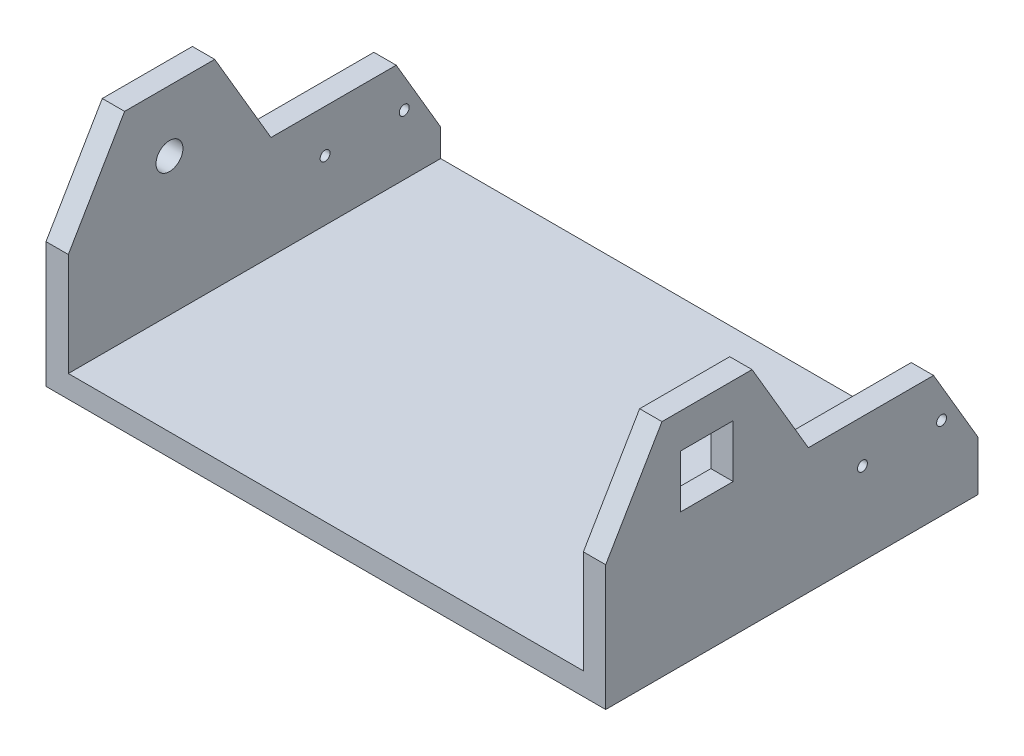
ISO-10303-21;
HEADER;
FILE_DESCRIPTION(('STEP AP214'),'2;1');
FILE_NAME('part.step','',(''),(''),'','','');
FILE_SCHEMA(('AUTOMOTIVE_DESIGN { 1 0 10303 214 1 1 1 1 }'));
ENDSEC;
DATA;
#1=APPLICATION_CONTEXT('core data for automotive mechanical design processes');
#2=APPLICATION_PROTOCOL_DEFINITION('international standard','automotive_design',2000,#1);
#3=PRODUCT_CONTEXT('',#1,'mechanical');
#4=PRODUCT('Part','Part','',(#3));
#5=PRODUCT_RELATED_PRODUCT_CATEGORY('part','',(#4));
#6=PRODUCT_DEFINITION_FORMATION('','',#4);
#7=PRODUCT_DEFINITION_CONTEXT('part definition',#1,'design');
#8=PRODUCT_DEFINITION('design','',#6,#7);
#9=PRODUCT_DEFINITION_SHAPE('','',#8);
#10=(LENGTH_UNIT() NAMED_UNIT(*) SI_UNIT(.MILLI.,.METRE.));
#11=(NAMED_UNIT(*) PLANE_ANGLE_UNIT() SI_UNIT($,.RADIAN.));
#12=(NAMED_UNIT(*) SI_UNIT($,.STERADIAN.) SOLID_ANGLE_UNIT());
#13=UNCERTAINTY_MEASURE_WITH_UNIT(LENGTH_MEASURE(1.E-05),#10,'distance_accuracy_value','');
#14=(GEOMETRIC_REPRESENTATION_CONTEXT(3) GLOBAL_UNCERTAINTY_ASSIGNED_CONTEXT((#13)) GLOBAL_UNIT_ASSIGNED_CONTEXT((#10,
#11,#12)) REPRESENTATION_CONTEXT('',''));
#15=CARTESIAN_POINT('',(0.,0.,0.));
#16=DIRECTION('',(0.,0.,1.));
#17=DIRECTION('',(1.,0.,0.));
#18=AXIS2_PLACEMENT_3D('',#15,#16,#17);
#19=CARTESIAN_POINT('',(0.,18.,0.));
#20=DIRECTION('',(0.,0.,-1.));
#21=DIRECTION('',(-1.,0.,0.));
#22=AXIS2_PLACEMENT_3D('',#19,#20,#21);
#23=PLANE('',#22);
#24=DIRECTION('',(1.,0.,0.));
#25=VECTOR('',#24,1.);
#26=CARTESIAN_POINT('',(0.,18.,0.));
#27=LINE('',#26,#25);
#28=CARTESIAN_POINT('',(18.,18.,0.));
#29=VERTEX_POINT('',#28);
#30=CARTESIAN_POINT('',(433.,18.,0.));
#31=VERTEX_POINT('',#30);
#32=EDGE_CURVE('E172',#29,#31,#27,.T.);
#33=ORIENTED_EDGE('',*,*,#32,.F.);
#34=DIRECTION('',(0.,1.,0.));
#35=VECTOR('',#34,1.);
#36=CARTESIAN_POINT('',(18.,101.059625537758,0.));
#37=LINE('',#36,#35);
#38=CARTESIAN_POINT('',(18.,101.059625537758,0.));
#39=VERTEX_POINT('',#38);
#40=EDGE_CURVE('E166',#29,#39,#37,.T.);
#41=ORIENTED_EDGE('',*,*,#40,.T.);
#42=DIRECTION('',(-1.,0.,0.));
#43=VECTOR('',#42,1.);
#44=CARTESIAN_POINT('',(18.,101.059625537758,0.));
#45=LINE('',#44,#43);
#46=CARTESIAN_POINT('',(0.,101.059625537758,0.));
#47=VERTEX_POINT('',#46);
#48=EDGE_CURVE('E169',#39,#47,#45,.T.);
#49=ORIENTED_EDGE('',*,*,#48,.T.);
#50=DIRECTION('',(0.,-1.,0.));
#51=VECTOR('',#50,1.);
#52=CARTESIAN_POINT('',(0.,18.,0.));
#53=LINE('',#52,#51);
#54=CARTESIAN_POINT('',(0.,0.,0.));
#55=VERTEX_POINT('',#54);
#56=EDGE_CURVE('E328',#47,#55,#53,.T.);
#57=ORIENTED_EDGE('',*,*,#56,.T.);
#58=DIRECTION('',(1.,0.,0.));
#59=VECTOR('',#58,1.);
#60=CARTESIAN_POINT('',(0.,0.,0.));
#61=LINE('',#60,#59);
#62=CARTESIAN_POINT('',(451.,0.,0.));
#63=VERTEX_POINT('',#62);
#64=EDGE_CURVE('E324',#55,#63,#61,.T.);
#65=ORIENTED_EDGE('',*,*,#64,.T.);
#66=DIRECTION('',(0.,-1.,0.));
#67=VECTOR('',#66,1.);
#68=CARTESIAN_POINT('',(451.,18.,0.));
#69=LINE('',#68,#67);
#70=CARTESIAN_POINT('',(451.,101.059625537758,0.));
#71=VERTEX_POINT('',#70);
#72=EDGE_CURVE('E11',#71,#63,#69,.T.);
#73=ORIENTED_EDGE('',*,*,#72,.F.);
#74=DIRECTION('',(1.,0.,0.));
#75=VECTOR('',#74,1.);
#76=CARTESIAN_POINT('',(433.,101.059625537758,0.));
#77=LINE('',#76,#75);
#78=CARTESIAN_POINT('',(433.,101.059625537758,0.));
#79=VERTEX_POINT('',#78);
#80=EDGE_CURVE('E309',#79,#71,#77,.T.);
#81=ORIENTED_EDGE('',*,*,#80,.F.);
#82=DIRECTION('',(0.,-1.,0.));
#83=VECTOR('',#82,1.);
#84=CARTESIAN_POINT('',(433.,0.,0.));
#85=LINE('',#84,#83);
#86=EDGE_CURVE('E293',#79,#31,#85,.T.);
#87=ORIENTED_EDGE('',*,*,#86,.T.);
#88=EDGE_LOOP('',(#33,#41,#49,#57,#65,#73,#81,#87));
#89=FACE_BOUND('',#88,.T.);
#90=ADVANCED_FACE('F32',(#89),#23,.F.);
#91=CARTESIAN_POINT('',(451.,18.,-300.));
#92=DIRECTION('',(-1.,0.,0.));
#93=DIRECTION('',(0.,0.,1.));
#94=AXIS2_PLACEMENT_3D('',#91,#92,#93);
#95=PLANE('',#94);
#96=DIRECTION('',(0.,0.,-1.));
#97=VECTOR('',#96,1.);
#98=CARTESIAN_POINT('',(451.,0.,-300.));
#99=LINE('',#98,#97);
#100=CARTESIAN_POINT('',(451.,0.,-300.));
#101=VERTEX_POINT('',#100);
#102=EDGE_CURVE('E330',#63,#101,#99,.T.);
#103=ORIENTED_EDGE('',*,*,#102,.T.);
#104=DIRECTION('',(0.,-1.,0.));
#105=VECTOR('',#104,1.);
#106=CARTESIAN_POINT('',(451.,18.,-300.));
#107=LINE('',#106,#105);
#108=CARTESIAN_POINT('',(451.,40.1073741437581,-300.));
#109=VERTEX_POINT('',#108);
#110=EDGE_CURVE('E39',#109,#101,#107,.T.);
#111=ORIENTED_EDGE('',*,*,#110,.F.);
#112=DIRECTION('',(0.,0.862288015351537,0.5064181854763));
#113=VECTOR('',#112,1.);
#114=CARTESIAN_POINT('',(451.,101.059625537758,-264.202994820634));
#115=LINE('',#114,#113);
#116=CARTESIAN_POINT('',(451.,101.059625537758,-264.202994820634));
#117=VERTEX_POINT('',#116);
#118=EDGE_CURVE('E268',#109,#117,#115,.T.);
#119=ORIENTED_EDGE('',*,*,#118,.T.);
#120=DIRECTION('',(0.,0.,1.));
#121=VECTOR('',#120,1.);
#122=CARTESIAN_POINT('',(451.,101.059625537758,-163.295274023895));
#123=LINE('',#122,#121);
#124=CARTESIAN_POINT('',(451.,101.059625537758,-163.295274023895));
#125=VERTEX_POINT('',#124);
#126=EDGE_CURVE('E298',#117,#125,#123,.T.);
#127=ORIENTED_EDGE('',*,*,#126,.T.);
#128=DIRECTION('',(0.,0.862288015351537,0.5064181854763));
#129=VECTOR('',#128,1.);
#130=CARTESIAN_POINT('',(451.,178.261418027833,-117.954980557792));
#131=LINE('',#130,#129);
#132=CARTESIAN_POINT('',(451.,178.261418027833,-117.954980557792));
#133=VERTEX_POINT('',#132);
#134=EDGE_CURVE('E301',#125,#133,#131,.T.);
#135=ORIENTED_EDGE('',*,*,#134,.T.);
#136=DIRECTION('',(0.,0.,1.));
#137=VECTOR('',#136,1.);
#138=CARTESIAN_POINT('',(451.,178.261418027833,-45.3423301195985));
#139=LINE('',#138,#137);
#140=CARTESIAN_POINT('',(451.,178.261418027833,-45.3423301195985));
#141=VERTEX_POINT('',#140);
#142=EDGE_CURVE('E304',#133,#141,#139,.T.);
#143=ORIENTED_EDGE('',*,*,#142,.T.);
#144=DIRECTION('',(0.,-0.862278081766698,0.506435099202991));
#145=VECTOR('',#144,1.);
#146=CARTESIAN_POINT('',(451.,101.059625537758,0.));
#147=LINE('',#146,#145);
#148=EDGE_CURVE('E278',#141,#71,#147,.T.);
#149=ORIENTED_EDGE('',*,*,#148,.T.);
#150=ORIENTED_EDGE('',*,*,#72,.T.);
#151=EDGE_LOOP('',(#103,#111,#119,#127,#135,#143,#149,#150));
#152=FACE_BOUND('',#151,.T.);
#153=CARTESIAN_POINT('',(451.,66.5,-270.64));
#154=DIRECTION('',(1.,0.,0.));
#155=DIRECTION('',(0.,0.,-1.));
#156=AXIS2_PLACEMENT_3D('',#153,#154,#155);
#157=CIRCLE('',#156,3.99999999999999);
#158=CARTESIAN_POINT('',(451.,66.5,-274.64));
#159=VERTEX_POINT('',#158);
#160=EDGE_CURVE('E230',#159,#159,#157,.T.);
#161=ORIENTED_EDGE('',*,*,#160,.F.);
#162=EDGE_LOOP('',(#161));
#163=FACE_BOUND('',#162,.T.);
#164=CARTESIAN_POINT('',(451.,66.5,-206.89));
#165=DIRECTION('',(1.,0.,0.));
#166=DIRECTION('',(0.,0.,-1.));
#167=AXIS2_PLACEMENT_3D('',#164,#165,#166);
#168=CIRCLE('',#167,3.99999999999999);
#169=CARTESIAN_POINT('',(451.,66.5,-210.89));
#170=VERTEX_POINT('',#169);
#171=EDGE_CURVE('E234',#170,#170,#168,.T.);
#172=ORIENTED_EDGE('',*,*,#171,.F.);
#173=EDGE_LOOP('',(#172));
#174=FACE_BOUND('',#173,.T.);
#175=DIRECTION('',(0.,0.,1.));
#176=VECTOR('',#175,1.);
#177=CARTESIAN_POINT('',(451.,150.25,-60.25));
#178=LINE('',#177,#176);
#179=CARTESIAN_POINT('',(451.,150.25,-102.75));
#180=VERTEX_POINT('',#179);
#181=CARTESIAN_POINT('',(451.,150.25,-60.25));
#182=VERTEX_POINT('',#181);
#183=EDGE_CURVE('E258',#180,#182,#178,.T.);
#184=ORIENTED_EDGE('',*,*,#183,.F.);
#185=DIRECTION('',(0.,1.,0.));
#186=VECTOR('',#185,1.);
#187=CARTESIAN_POINT('',(451.,150.25,-102.75));
#188=LINE('',#187,#186);
#189=CARTESIAN_POINT('',(451.,107.75,-102.75));
#190=VERTEX_POINT('',#189);
#191=EDGE_CURVE('E240',#190,#180,#188,.T.);
#192=ORIENTED_EDGE('',*,*,#191,.F.);
#193=DIRECTION('',(0.,0.,-1.));
#194=VECTOR('',#193,1.);
#195=CARTESIAN_POINT('',(451.,107.75,-60.25));
#196=LINE('',#195,#194);
#197=CARTESIAN_POINT('',(451.,107.75,-60.25));
#198=VERTEX_POINT('',#197);
#199=EDGE_CURVE('E247',#198,#190,#196,.T.);
#200=ORIENTED_EDGE('',*,*,#199,.F.);
#201=DIRECTION('',(0.,-1.,0.));
#202=VECTOR('',#201,1.);
#203=CARTESIAN_POINT('',(451.,150.25,-60.25));
#204=LINE('',#203,#202);
#205=EDGE_CURVE('E261',#182,#198,#204,.T.);
#206=ORIENTED_EDGE('',*,*,#205,.F.);
#207=EDGE_LOOP('',(#184,#192,#200,#206));
#208=FACE_BOUND('',#207,.T.);
#209=ADVANCED_FACE('F358',(#152,#163,#174,#208),#95,.F.);
#210=CARTESIAN_POINT('',(0.,18.,-300.));
#211=DIRECTION('',(0.,0.,1.));
#212=DIRECTION('',(1.,0.,0.));
#213=AXIS2_PLACEMENT_3D('',#210,#211,#212);
#214=PLANE('',#213);
#215=DIRECTION('',(-1.,0.,0.));
#216=VECTOR('',#215,1.);
#217=CARTESIAN_POINT('',(0.,0.,-300.));
#218=LINE('',#217,#216);
#219=CARTESIAN_POINT('',(0.,0.,-300.));
#220=VERTEX_POINT('',#219);
#221=EDGE_CURVE('E332',#101,#220,#218,.T.);
#222=ORIENTED_EDGE('',*,*,#221,.T.);
#223=DIRECTION('',(0.,-1.,0.));
#224=VECTOR('',#223,1.);
#225=CARTESIAN_POINT('',(0.,18.,-300.));
#226=LINE('',#225,#224);
#227=CARTESIAN_POINT('',(0.,40.1073741437581,-300.));
#228=VERTEX_POINT('',#227);
#229=EDGE_CURVE('E336',#228,#220,#226,.T.);
#230=ORIENTED_EDGE('',*,*,#229,.F.);
#231=DIRECTION('',(-1.,0.,0.));
#232=VECTOR('',#231,1.);
#233=CARTESIAN_POINT('',(18.,40.1073741437581,-300.));
#234=LINE('',#233,#232);
#235=CARTESIAN_POINT('',(18.,40.1073741437581,-300.));
#236=VERTEX_POINT('',#235);
#237=EDGE_CURVE('E219',#236,#228,#234,.T.);
#238=ORIENTED_EDGE('',*,*,#237,.F.);
#239=DIRECTION('',(0.,-1.,0.));
#240=VECTOR('',#239,1.);
#241=CARTESIAN_POINT('',(18.,0.,-300.));
#242=LINE('',#241,#240);
#243=CARTESIAN_POINT('',(18.,18.,-300.));
#244=VERTEX_POINT('',#243);
#245=EDGE_CURVE('E184',#236,#244,#242,.T.);
#246=ORIENTED_EDGE('',*,*,#245,.T.);
#247=DIRECTION('',(-1.,0.,0.));
#248=VECTOR('',#247,1.);
#249=CARTESIAN_POINT('',(0.,18.,-300.));
#250=LINE('',#249,#248);
#251=CARTESIAN_POINT('',(433.,18.,-300.));
#252=VERTEX_POINT('',#251);
#253=EDGE_CURVE('E46',#252,#244,#250,.T.);
#254=ORIENTED_EDGE('',*,*,#253,.F.);
#255=DIRECTION('',(0.,1.,0.));
#256=VECTOR('',#255,1.);
#257=CARTESIAN_POINT('',(433.,40.1073741437581,-300.));
#258=LINE('',#257,#256);
#259=CARTESIAN_POINT('',(433.,40.1073741437581,-300.));
#260=VERTEX_POINT('',#259);
#261=EDGE_CURVE('E275',#252,#260,#258,.T.);
#262=ORIENTED_EDGE('',*,*,#261,.T.);
#263=DIRECTION('',(1.,0.,0.));
#264=VECTOR('',#263,1.);
#265=CARTESIAN_POINT('',(433.,40.1073741437581,-300.));
#266=LINE('',#265,#264);
#267=EDGE_CURVE('E295',#260,#109,#266,.T.);
#268=ORIENTED_EDGE('',*,*,#267,.T.);
#269=ORIENTED_EDGE('',*,*,#110,.T.);
#270=EDGE_LOOP('',(#222,#230,#238,#246,#254,#262,#268,#269));
#271=FACE_BOUND('',#270,.T.);
#272=ADVANCED_FACE('F341',(#271),#214,.F.);
#273=CARTESIAN_POINT('',(0.,18.,-300.));
#274=DIRECTION('',(1.,0.,0.));
#275=DIRECTION('',(0.,0.,-1.));
#276=AXIS2_PLACEMENT_3D('',#273,#274,#275);
#277=PLANE('',#276);
#278=DIRECTION('',(0.,0.,1.));
#279=VECTOR('',#278,1.);
#280=CARTESIAN_POINT('',(0.,0.,-300.));
#281=LINE('',#280,#279);
#282=EDGE_CURVE('E326',#220,#55,#281,.T.);
#283=ORIENTED_EDGE('',*,*,#282,.T.);
#284=ORIENTED_EDGE('',*,*,#56,.F.);
#285=DIRECTION('',(0.,0.862278081766698,-0.506435099202991));
#286=VECTOR('',#285,1.);
#287=CARTESIAN_POINT('',(0.,178.261418027833,-45.3423301195985));
#288=LINE('',#287,#286);
#289=CARTESIAN_POINT('',(0.,178.261418027833,-45.3423301195985));
#290=VERTEX_POINT('',#289);
#291=EDGE_CURVE('E182',#47,#290,#288,.T.);
#292=ORIENTED_EDGE('',*,*,#291,.T.);
#293=DIRECTION('',(0.,0.,-1.));
#294=VECTOR('',#293,1.);
#295=CARTESIAN_POINT('',(0.,178.261418027833,-117.954980557792));
#296=LINE('',#295,#294);
#297=CARTESIAN_POINT('',(0.,178.261418027833,-117.954980557792));
#298=VERTEX_POINT('',#297);
#299=EDGE_CURVE('E207',#290,#298,#296,.T.);
#300=ORIENTED_EDGE('',*,*,#299,.T.);
#301=DIRECTION('',(0.,-0.862288015351537,-0.5064181854763));
#302=VECTOR('',#301,1.);
#303=CARTESIAN_POINT('',(0.,101.059625537758,-163.295274023895));
#304=LINE('',#303,#302);
#305=CARTESIAN_POINT('',(0.,101.059625537758,-163.295274023895));
#306=VERTEX_POINT('',#305);
#307=EDGE_CURVE('E211',#298,#306,#304,.T.);
#308=ORIENTED_EDGE('',*,*,#307,.T.);
#309=DIRECTION('',(0.,0.,-1.));
#310=VECTOR('',#309,1.);
#311=CARTESIAN_POINT('',(0.,101.059625537758,-264.202994820634));
#312=LINE('',#311,#310);
#313=CARTESIAN_POINT('',(0.,101.059625537758,-264.202994820634));
#314=VERTEX_POINT('',#313);
#315=EDGE_CURVE('E214',#306,#314,#312,.T.);
#316=ORIENTED_EDGE('',*,*,#315,.T.);
#317=DIRECTION('',(0.,-0.862288015351537,-0.5064181854763));
#318=VECTOR('',#317,1.);
#319=CARTESIAN_POINT('',(0.,40.1073741437581,-300.));
#320=LINE('',#319,#318);
#321=EDGE_CURVE('E176',#314,#228,#320,.T.);
#322=ORIENTED_EDGE('',*,*,#321,.T.);
#323=ORIENTED_EDGE('',*,*,#229,.T.);
#324=EDGE_LOOP('',(#283,#284,#292,#300,#308,#316,#322,#323));
#325=FACE_BOUND('',#324,.T.);
#326=CARTESIAN_POINT('',(0.,66.5,-206.89));
#327=DIRECTION('',(-1.,0.,0.));
#328=DIRECTION('',(0.,0.,1.));
#329=AXIS2_PLACEMENT_3D('',#326,#327,#328);
#330=CIRCLE('',#329,4.00000000000002);
#331=CARTESIAN_POINT('',(0.,66.5,-202.89));
#332=VERTEX_POINT('',#331);
#333=EDGE_CURVE('E657',#332,#332,#330,.T.);
#334=ORIENTED_EDGE('',*,*,#333,.F.);
#335=EDGE_LOOP('',(#334));
#336=FACE_BOUND('',#335,.T.);
#337=CARTESIAN_POINT('',(0.,66.5,-270.64));
#338=DIRECTION('',(-1.,0.,0.));
#339=DIRECTION('',(0.,0.,1.));
#340=AXIS2_PLACEMENT_3D('',#337,#338,#339);
#341=CIRCLE('',#340,3.99999999999999);
#342=CARTESIAN_POINT('',(0.,66.5,-266.64));
#343=VERTEX_POINT('',#342);
#344=EDGE_CURVE('E659',#343,#343,#341,.T.);
#345=ORIENTED_EDGE('',*,*,#344,.F.);
#346=EDGE_LOOP('',(#345));
#347=FACE_BOUND('',#346,.T.);
#348=CARTESIAN_POINT('',(0.,129.,-81.5));
#349=DIRECTION('',(-1.,0.,0.));
#350=DIRECTION('',(0.,0.,1.));
#351=AXIS2_PLACEMENT_3D('',#348,#349,#350);
#352=CIRCLE('',#351,10.85);
#353=CARTESIAN_POINT('',(0.,129.,-70.65));
#354=VERTEX_POINT('',#353);
#355=EDGE_CURVE('E665',#354,#354,#352,.T.);
#356=ORIENTED_EDGE('',*,*,#355,.F.);
#357=EDGE_LOOP('',(#356));
#358=FACE_BOUND('',#357,.T.);
#359=ADVANCED_FACE('F351',(#325,#336,#347,#358),#277,.F.);
#360=CARTESIAN_POINT('',(0.,18.,0.));
#361=DIRECTION('',(0.,-1.,0.));
#362=DIRECTION('',(0.,0.,-1.));
#363=AXIS2_PLACEMENT_3D('',#360,#361,#362);
#364=PLANE('',#363);
#365=ORIENTED_EDGE('',*,*,#253,.T.);
#366=DIRECTION('',(0.,0.,1.));
#367=VECTOR('',#366,1.);
#368=CARTESIAN_POINT('',(18.,18.,0.));
#369=LINE('',#368,#367);
#370=EDGE_CURVE('E50',#244,#29,#369,.T.);
#371=ORIENTED_EDGE('',*,*,#370,.T.);
#372=ORIENTED_EDGE('',*,*,#32,.T.);
#373=DIRECTION('',(0.,0.,-1.));
#374=VECTOR('',#373,1.);
#375=CARTESIAN_POINT('',(433.,18.,0.));
#376=LINE('',#375,#374);
#377=EDGE_CURVE('E312',#31,#252,#376,.T.);
#378=ORIENTED_EDGE('',*,*,#377,.T.);
#379=EDGE_LOOP('',(#365,#371,#372,#378));
#380=FACE_BOUND('',#379,.T.);
#381=ADVANCED_FACE('F371',(#380),#364,.F.);
#382=CARTESIAN_POINT('',(0.,0.,0.));
#383=DIRECTION('',(0.,-1.,0.));
#384=DIRECTION('',(0.,0.,-1.));
#385=AXIS2_PLACEMENT_3D('',#382,#383,#384);
#386=PLANE('',#385);
#387=ORIENTED_EDGE('',*,*,#102,.F.);
#388=ORIENTED_EDGE('',*,*,#64,.F.);
#389=ORIENTED_EDGE('',*,*,#282,.F.);
#390=ORIENTED_EDGE('',*,*,#221,.F.);
#391=EDGE_LOOP('',(#387,#388,#389,#390));
#392=FACE_BOUND('',#391,.T.);
#393=ADVANCED_FACE('F348',(#392),#386,.T.);
#394=CARTESIAN_POINT('',(433.,0.,0.));
#395=DIRECTION('',(-1.,0.,0.));
#396=DIRECTION('',(0.,0.,1.));
#397=AXIS2_PLACEMENT_3D('',#394,#395,#396);
#398=PLANE('',#397);
#399=DIRECTION('',(0.,1.,0.));
#400=VECTOR('',#399,1.);
#401=CARTESIAN_POINT('',(433.,150.25,-102.75));
#402=LINE('',#401,#400);
#403=CARTESIAN_POINT('',(433.,107.75,-102.75));
#404=VERTEX_POINT('',#403);
#405=CARTESIAN_POINT('',(433.,150.25,-102.75));
#406=VERTEX_POINT('',#405);
#407=EDGE_CURVE('E243',#404,#406,#402,.T.);
#408=ORIENTED_EDGE('',*,*,#407,.T.);
#409=DIRECTION('',(0.,0.,1.));
#410=VECTOR('',#409,1.);
#411=CARTESIAN_POINT('',(433.,150.25,-60.25));
#412=LINE('',#411,#410);
#413=CARTESIAN_POINT('',(433.,150.25,-60.25));
#414=VERTEX_POINT('',#413);
#415=EDGE_CURVE('E246',#406,#414,#412,.T.);
#416=ORIENTED_EDGE('',*,*,#415,.T.);
#417=DIRECTION('',(0.,-1.,0.));
#418=VECTOR('',#417,1.);
#419=CARTESIAN_POINT('',(433.,150.25,-60.25));
#420=LINE('',#419,#418);
#421=CARTESIAN_POINT('',(433.,107.75,-60.25));
#422=VERTEX_POINT('',#421);
#423=EDGE_CURVE('E250',#414,#422,#420,.T.);
#424=ORIENTED_EDGE('',*,*,#423,.T.);
#425=DIRECTION('',(0.,0.,-1.));
#426=VECTOR('',#425,1.);
#427=CARTESIAN_POINT('',(433.,107.75,-60.25));
#428=LINE('',#427,#426);
#429=EDGE_CURVE('E253',#422,#404,#428,.T.);
#430=ORIENTED_EDGE('',*,*,#429,.T.);
#431=EDGE_LOOP('',(#408,#416,#424,#430));
#432=FACE_BOUND('',#431,.T.);
#433=CARTESIAN_POINT('',(433.,66.5,-206.89));
#434=DIRECTION('',(1.,0.,0.));
#435=DIRECTION('',(0.,0.,-1.));
#436=AXIS2_PLACEMENT_3D('',#433,#434,#435);
#437=CIRCLE('',#436,3.99999999999999);
#438=CARTESIAN_POINT('',(433.,66.5,-210.89));
#439=VERTEX_POINT('',#438);
#440=EDGE_CURVE('E237',#439,#439,#437,.T.);
#441=ORIENTED_EDGE('',*,*,#440,.T.);
#442=EDGE_LOOP('',(#441));
#443=FACE_BOUND('',#442,.T.);
#444=CARTESIAN_POINT('',(433.,66.5,-270.64));
#445=DIRECTION('',(1.,0.,0.));
#446=DIRECTION('',(0.,0.,-1.));
#447=AXIS2_PLACEMENT_3D('',#444,#445,#446);
#448=CIRCLE('',#447,3.99999999999999);
#449=CARTESIAN_POINT('',(433.,66.5,-274.64));
#450=VERTEX_POINT('',#449);
#451=EDGE_CURVE('E231',#450,#450,#448,.T.);
#452=ORIENTED_EDGE('',*,*,#451,.T.);
#453=EDGE_LOOP('',(#452));
#454=FACE_BOUND('',#453,.T.);
#455=ORIENTED_EDGE('',*,*,#377,.F.);
#456=ORIENTED_EDGE('',*,*,#86,.F.);
#457=DIRECTION('',(0.,-0.862278081766698,0.506435099202991));
#458=VECTOR('',#457,1.);
#459=CARTESIAN_POINT('',(433.,101.059625537758,0.));
#460=LINE('',#459,#458);
#461=CARTESIAN_POINT('',(433.,178.261418027833,-45.3423301195985));
#462=VERTEX_POINT('',#461);
#463=EDGE_CURVE('E290',#462,#79,#460,.T.);
#464=ORIENTED_EDGE('',*,*,#463,.F.);
#465=DIRECTION('',(0.,0.,1.));
#466=VECTOR('',#465,1.);
#467=CARTESIAN_POINT('',(433.,178.261418027833,-45.3423301195985));
#468=LINE('',#467,#466);
#469=CARTESIAN_POINT('',(433.,178.261418027833,-117.954980557792));
#470=VERTEX_POINT('',#469);
#471=EDGE_CURVE('E287',#470,#462,#468,.T.);
#472=ORIENTED_EDGE('',*,*,#471,.F.);
#473=DIRECTION('',(0.,0.862288015351537,0.5064181854763));
#474=VECTOR('',#473,1.);
#475=CARTESIAN_POINT('',(433.,178.261418027833,-117.954980557792));
#476=LINE('',#475,#474);
#477=CARTESIAN_POINT('',(433.,101.059625537758,-163.295274023895));
#478=VERTEX_POINT('',#477);
#479=EDGE_CURVE('E284',#478,#470,#476,.T.);
#480=ORIENTED_EDGE('',*,*,#479,.F.);
#481=DIRECTION('',(0.,0.,1.));
#482=VECTOR('',#481,1.);
#483=CARTESIAN_POINT('',(433.,101.059625537758,-163.295274023895));
#484=LINE('',#483,#482);
#485=CARTESIAN_POINT('',(433.,101.059625537758,-264.202994820634));
#486=VERTEX_POINT('',#485);
#487=EDGE_CURVE('E281',#486,#478,#484,.T.);
#488=ORIENTED_EDGE('',*,*,#487,.F.);
#489=DIRECTION('',(0.,0.862288015351537,0.5064181854763));
#490=VECTOR('',#489,1.);
#491=CARTESIAN_POINT('',(433.,101.059625537758,-264.202994820634));
#492=LINE('',#491,#490);
#493=EDGE_CURVE('E277',#260,#486,#492,.T.);
#494=ORIENTED_EDGE('',*,*,#493,.F.);
#495=ORIENTED_EDGE('',*,*,#261,.F.);
#496=EDGE_LOOP('',(#455,#456,#464,#472,#480,#488,#494,#495));
#497=FACE_BOUND('',#496,.T.);
#498=ADVANCED_FACE('F367',(#432,#443,#454,#497),#398,.T.);
#499=CARTESIAN_POINT('',(433.,101.059625537758,0.));
#500=DIRECTION('',(0.,0.506435099202991,0.862278081766698));
#501=DIRECTION('',(0.,-0.862278081766698,0.506435099202991));
#502=AXIS2_PLACEMENT_3D('',#499,#500,#501);
#503=PLANE('',#502);
#504=ORIENTED_EDGE('',*,*,#148,.F.);
#505=DIRECTION('',(1.,0.,0.));
#506=VECTOR('',#505,1.);
#507=CARTESIAN_POINT('',(433.,178.261418027833,-45.3423301195985));
#508=LINE('',#507,#506);
#509=EDGE_CURVE('E313',#462,#141,#508,.T.);
#510=ORIENTED_EDGE('',*,*,#509,.F.);
#511=ORIENTED_EDGE('',*,*,#463,.T.);
#512=ORIENTED_EDGE('',*,*,#80,.T.);
#513=EDGE_LOOP('',(#504,#510,#511,#512));
#514=FACE_BOUND('',#513,.T.);
#515=ADVANCED_FACE('F356',(#514),#503,.T.);
#516=CARTESIAN_POINT('',(433.,178.261418027833,-45.3423301195985));
#517=DIRECTION('',(0.,1.,0.));
#518=DIRECTION('',(0.,0.,1.));
#519=AXIS2_PLACEMENT_3D('',#516,#517,#518);
#520=PLANE('',#519);
#521=ORIENTED_EDGE('',*,*,#142,.F.);
#522=DIRECTION('',(1.,0.,0.));
#523=VECTOR('',#522,1.);
#524=CARTESIAN_POINT('',(433.,178.261418027833,-117.954980557792));
#525=LINE('',#524,#523);
#526=EDGE_CURVE('E315',#470,#133,#525,.T.);
#527=ORIENTED_EDGE('',*,*,#526,.F.);
#528=ORIENTED_EDGE('',*,*,#471,.T.);
#529=ORIENTED_EDGE('',*,*,#509,.T.);
#530=EDGE_LOOP('',(#521,#527,#528,#529));
#531=FACE_BOUND('',#530,.T.);
#532=ADVANCED_FACE('F363',(#531),#520,.T.);
#533=CARTESIAN_POINT('',(433.,178.261418027833,-117.954980557792));
#534=DIRECTION('',(0.,0.5064181854763,-0.862288015351537));
#535=DIRECTION('',(0.,0.862288015351537,0.5064181854763));
#536=AXIS2_PLACEMENT_3D('',#533,#534,#535);
#537=PLANE('',#536);
#538=ORIENTED_EDGE('',*,*,#134,.F.);
#539=DIRECTION('',(1.,0.,0.));
#540=VECTOR('',#539,1.);
#541=CARTESIAN_POINT('',(433.,101.059625537758,-163.295274023895));
#542=LINE('',#541,#540);
#543=EDGE_CURVE('E317',#478,#125,#542,.T.);
#544=ORIENTED_EDGE('',*,*,#543,.F.);
#545=ORIENTED_EDGE('',*,*,#479,.T.);
#546=ORIENTED_EDGE('',*,*,#526,.T.);
#547=EDGE_LOOP('',(#538,#544,#545,#546));
#548=FACE_BOUND('',#547,.T.);
#549=ADVANCED_FACE('F420',(#548),#537,.T.);
#550=CARTESIAN_POINT('',(433.,101.059625537758,-163.295274023895));
#551=DIRECTION('',(0.,1.,0.));
#552=DIRECTION('',(0.,0.,1.));
#553=AXIS2_PLACEMENT_3D('',#550,#551,#552);
#554=PLANE('',#553);
#555=ORIENTED_EDGE('',*,*,#126,.F.);
#556=DIRECTION('',(1.,0.,0.));
#557=VECTOR('',#556,1.);
#558=CARTESIAN_POINT('',(433.,101.059625537758,-264.202994820634));
#559=LINE('',#558,#557);
#560=EDGE_CURVE('E319',#486,#117,#559,.T.);
#561=ORIENTED_EDGE('',*,*,#560,.F.);
#562=ORIENTED_EDGE('',*,*,#487,.T.);
#563=ORIENTED_EDGE('',*,*,#543,.T.);
#564=EDGE_LOOP('',(#555,#561,#562,#563));
#565=FACE_BOUND('',#564,.T.);
#566=ADVANCED_FACE('F416',(#565),#554,.T.);
#567=CARTESIAN_POINT('',(433.,101.059625537758,-264.202994820634));
#568=DIRECTION('',(0.,0.5064181854763,-0.862288015351537));
#569=DIRECTION('',(0.,0.862288015351537,0.5064181854763));
#570=AXIS2_PLACEMENT_3D('',#567,#568,#569);
#571=PLANE('',#570);
#572=ORIENTED_EDGE('',*,*,#118,.F.);
#573=ORIENTED_EDGE('',*,*,#267,.F.);
#574=ORIENTED_EDGE('',*,*,#493,.T.);
#575=ORIENTED_EDGE('',*,*,#560,.T.);
#576=EDGE_LOOP('',(#572,#573,#574,#575));
#577=FACE_BOUND('',#576,.T.);
#578=ADVANCED_FACE('F412',(#577),#571,.T.);
#579=CARTESIAN_POINT('',(433.,150.25,-102.75));
#580=DIRECTION('',(0.,0.,-1.));
#581=DIRECTION('',(0.,1.,0.));
#582=AXIS2_PLACEMENT_3D('',#579,#580,#581);
#583=PLANE('',#582);
#584=ORIENTED_EDGE('',*,*,#191,.T.);
#585=DIRECTION('',(1.,0.,0.));
#586=VECTOR('',#585,1.);
#587=CARTESIAN_POINT('',(433.,150.25,-102.75));
#588=LINE('',#587,#586);
#589=EDGE_CURVE('E256',#406,#180,#588,.T.);
#590=ORIENTED_EDGE('',*,*,#589,.F.);
#591=ORIENTED_EDGE('',*,*,#407,.F.);
#592=DIRECTION('',(1.,0.,0.));
#593=VECTOR('',#592,1.);
#594=CARTESIAN_POINT('',(433.,107.75,-102.75));
#595=LINE('',#594,#593);
#596=EDGE_CURVE('E266',#404,#190,#595,.T.);
#597=ORIENTED_EDGE('',*,*,#596,.T.);
#598=EDGE_LOOP('',(#584,#590,#591,#597));
#599=FACE_BOUND('',#598,.T.);
#600=ADVANCED_FACE('F415',(#599),#583,.F.);
#601=CARTESIAN_POINT('',(433.,107.75,-60.25));
#602=DIRECTION('',(0.,-1.,0.));
#603=DIRECTION('',(0.,0.,-1.));
#604=AXIS2_PLACEMENT_3D('',#601,#602,#603);
#605=PLANE('',#604);
#606=ORIENTED_EDGE('',*,*,#199,.T.);
#607=ORIENTED_EDGE('',*,*,#596,.F.);
#608=ORIENTED_EDGE('',*,*,#429,.F.);
#609=DIRECTION('',(1.,0.,0.));
#610=VECTOR('',#609,1.);
#611=CARTESIAN_POINT('',(433.,107.75,-60.25));
#612=LINE('',#611,#610);
#613=EDGE_CURVE('E269',#422,#198,#612,.T.);
#614=ORIENTED_EDGE('',*,*,#613,.T.);
#615=EDGE_LOOP('',(#606,#607,#608,#614));
#616=FACE_BOUND('',#615,.T.);
#617=ADVANCED_FACE('F434',(#616),#605,.F.);
#618=CARTESIAN_POINT('',(433.,150.25,-60.25));
#619=DIRECTION('',(0.,0.,1.));
#620=DIRECTION('',(0.,-1.,0.));
#621=AXIS2_PLACEMENT_3D('',#618,#619,#620);
#622=PLANE('',#621);
#623=ORIENTED_EDGE('',*,*,#205,.T.);
#624=ORIENTED_EDGE('',*,*,#613,.F.);
#625=ORIENTED_EDGE('',*,*,#423,.F.);
#626=DIRECTION('',(1.,0.,0.));
#627=VECTOR('',#626,1.);
#628=CARTESIAN_POINT('',(433.,150.25,-60.25));
#629=LINE('',#628,#627);
#630=EDGE_CURVE('E271',#414,#182,#629,.T.);
#631=ORIENTED_EDGE('',*,*,#630,.T.);
#632=EDGE_LOOP('',(#623,#624,#625,#631));
#633=FACE_BOUND('',#632,.T.);
#634=ADVANCED_FACE('F440',(#633),#622,.F.);
#635=CARTESIAN_POINT('',(433.,150.25,-60.25));
#636=DIRECTION('',(0.,1.,0.));
#637=DIRECTION('',(0.,0.,1.));
#638=AXIS2_PLACEMENT_3D('',#635,#636,#637);
#639=PLANE('',#638);
#640=ORIENTED_EDGE('',*,*,#183,.T.);
#641=ORIENTED_EDGE('',*,*,#630,.F.);
#642=ORIENTED_EDGE('',*,*,#415,.F.);
#643=ORIENTED_EDGE('',*,*,#589,.T.);
#644=EDGE_LOOP('',(#640,#641,#642,#643));
#645=FACE_BOUND('',#644,.T.);
#646=ADVANCED_FACE('F436',(#645),#639,.F.);
#647=CARTESIAN_POINT('',(433.,66.5,-206.89));
#648=DIRECTION('',(1.,0.,0.));
#649=DIRECTION('',(0.,0.,-1.));
#650=AXIS2_PLACEMENT_3D('',#647,#648,#649);
#651=CYLINDRICAL_SURFACE('',#650,3.99999999999999);
#652=ORIENTED_EDGE('',*,*,#440,.F.);
#653=EDGE_LOOP('',(#652));
#654=FACE_BOUND('',#653,.T.);
#655=ORIENTED_EDGE('',*,*,#171,.T.);
#656=EDGE_LOOP('',(#655));
#657=FACE_BOUND('',#656,.T.);
#658=ADVANCED_FACE('F439',(#654,#657),#651,.F.);
#659=CARTESIAN_POINT('',(433.,66.5,-270.64));
#660=DIRECTION('',(1.,0.,0.));
#661=DIRECTION('',(0.,0.,-1.));
#662=AXIS2_PLACEMENT_3D('',#659,#660,#661);
#663=CYLINDRICAL_SURFACE('',#662,3.99999999999999);
#664=ORIENTED_EDGE('',*,*,#451,.F.);
#665=EDGE_LOOP('',(#664));
#666=FACE_BOUND('',#665,.T.);
#667=ORIENTED_EDGE('',*,*,#160,.T.);
#668=EDGE_LOOP('',(#667));
#669=FACE_BOUND('',#668,.T.);
#670=ADVANCED_FACE('F394',(#666,#669),#663,.F.);
#671=CARTESIAN_POINT('',(18.,0.,0.));
#672=DIRECTION('',(1.,0.,0.));
#673=DIRECTION('',(0.,0.,-1.));
#674=AXIS2_PLACEMENT_3D('',#671,#672,#673);
#675=PLANE('',#674);
#676=CARTESIAN_POINT('',(18.,129.,-81.5));
#677=DIRECTION('',(-1.,0.,0.));
#678=DIRECTION('',(0.,0.,1.));
#679=AXIS2_PLACEMENT_3D('',#676,#677,#678);
#680=CIRCLE('',#679,10.85);
#681=CARTESIAN_POINT('',(18.,129.,-70.65));
#682=VERTEX_POINT('',#681);
#683=EDGE_CURVE('E208',#682,#682,#680,.T.);
#684=ORIENTED_EDGE('',*,*,#683,.T.);
#685=EDGE_LOOP('',(#684));
#686=FACE_BOUND('',#685,.T.);
#687=CARTESIAN_POINT('',(18.,66.5,-270.64));
#688=DIRECTION('',(-1.,0.,0.));
#689=DIRECTION('',(0.,0.,1.));
#690=AXIS2_PLACEMENT_3D('',#687,#688,#689);
#691=CIRCLE('',#690,3.99999999999999);
#692=CARTESIAN_POINT('',(18.,66.5,-266.64));
#693=VERTEX_POINT('',#692);
#694=EDGE_CURVE('E662',#693,#693,#691,.T.);
#695=ORIENTED_EDGE('',*,*,#694,.T.);
#696=EDGE_LOOP('',(#695));
#697=FACE_BOUND('',#696,.T.);
#698=CARTESIAN_POINT('',(18.,66.5,-206.89));
#699=DIRECTION('',(-1.,0.,0.));
#700=DIRECTION('',(0.,0.,1.));
#701=AXIS2_PLACEMENT_3D('',#698,#699,#700);
#702=CIRCLE('',#701,4.00000000000002);
#703=CARTESIAN_POINT('',(18.,66.5,-202.89));
#704=VERTEX_POINT('',#703);
#705=EDGE_CURVE('E654',#704,#704,#702,.T.);
#706=ORIENTED_EDGE('',*,*,#705,.T.);
#707=EDGE_LOOP('',(#706));
#708=FACE_BOUND('',#707,.T.);
#709=ORIENTED_EDGE('',*,*,#370,.F.);
#710=ORIENTED_EDGE('',*,*,#245,.F.);
#711=DIRECTION('',(0.,-0.862288015351537,-0.5064181854763));
#712=VECTOR('',#711,1.);
#713=CARTESIAN_POINT('',(18.,40.1073741437581,-300.));
#714=LINE('',#713,#712);
#715=CARTESIAN_POINT('',(18.,101.059625537758,-264.202994820634));
#716=VERTEX_POINT('',#715);
#717=EDGE_CURVE('E201',#716,#236,#714,.T.);
#718=ORIENTED_EDGE('',*,*,#717,.F.);
#719=DIRECTION('',(0.,0.,-1.));
#720=VECTOR('',#719,1.);
#721=CARTESIAN_POINT('',(18.,101.059625537758,-264.202994820634));
#722=LINE('',#721,#720);
#723=CARTESIAN_POINT('',(18.,101.059625537758,-163.295274023895));
#724=VERTEX_POINT('',#723);
#725=EDGE_CURVE('E198',#724,#716,#722,.T.);
#726=ORIENTED_EDGE('',*,*,#725,.F.);
#727=DIRECTION('',(0.,-0.862288015351537,-0.5064181854763));
#728=VECTOR('',#727,1.);
#729=CARTESIAN_POINT('',(18.,101.059625537758,-163.295274023895));
#730=LINE('',#729,#728);
#731=CARTESIAN_POINT('',(18.,178.261418027833,-117.954980557792));
#732=VERTEX_POINT('',#731);
#733=EDGE_CURVE('E192',#732,#724,#730,.T.);
#734=ORIENTED_EDGE('',*,*,#733,.F.);
#735=DIRECTION('',(0.,0.,-1.));
#736=VECTOR('',#735,1.);
#737=CARTESIAN_POINT('',(18.,178.261418027833,-117.954980557792));
#738=LINE('',#737,#736);
#739=CARTESIAN_POINT('',(18.,178.261418027833,-45.3423301195985));
#740=VERTEX_POINT('',#739);
#741=EDGE_CURVE('E190',#740,#732,#738,.T.);
#742=ORIENTED_EDGE('',*,*,#741,.F.);
#743=DIRECTION('',(0.,0.862278081766698,-0.506435099202991));
#744=VECTOR('',#743,1.);
#745=CARTESIAN_POINT('',(18.,178.261418027833,-45.3423301195985));
#746=LINE('',#745,#744);
#747=EDGE_CURVE('E175',#39,#740,#746,.T.);
#748=ORIENTED_EDGE('',*,*,#747,.F.);
#749=ORIENTED_EDGE('',*,*,#40,.F.);
#750=EDGE_LOOP('',(#709,#710,#718,#726,#734,#742,#748,#749));
#751=FACE_BOUND('',#750,.T.);
#752=ADVANCED_FACE('F187',(#686,#697,#708,#751),#675,.T.);
#753=CARTESIAN_POINT('',(18.,40.1073741437581,-300.));
#754=DIRECTION('',(0.,0.5064181854763,-0.862288015351537));
#755=DIRECTION('',(0.,0.862288015351537,0.5064181854763));
#756=AXIS2_PLACEMENT_3D('',#753,#754,#755);
#757=PLANE('',#756);
#758=ORIENTED_EDGE('',*,*,#321,.F.);
#759=DIRECTION('',(-1.,0.,0.));
#760=VECTOR('',#759,1.);
#761=CARTESIAN_POINT('',(18.,101.059625537758,-264.202994820634));
#762=LINE('',#761,#760);
#763=EDGE_CURVE('E222',#716,#314,#762,.T.);
#764=ORIENTED_EDGE('',*,*,#763,.F.);
#765=ORIENTED_EDGE('',*,*,#717,.T.);
#766=ORIENTED_EDGE('',*,*,#237,.T.);
#767=EDGE_LOOP('',(#758,#764,#765,#766));
#768=FACE_BOUND('',#767,.T.);
#769=ADVANCED_FACE('F386',(#768),#757,.T.);
#770=CARTESIAN_POINT('',(18.,101.059625537758,-264.202994820634));
#771=DIRECTION('',(0.,1.,0.));
#772=DIRECTION('',(0.,0.,1.));
#773=AXIS2_PLACEMENT_3D('',#770,#771,#772);
#774=PLANE('',#773);
#775=ORIENTED_EDGE('',*,*,#315,.F.);
#776=DIRECTION('',(-1.,0.,0.));
#777=VECTOR('',#776,1.);
#778=CARTESIAN_POINT('',(18.,101.059625537758,-163.295274023895));
#779=LINE('',#778,#777);
#780=EDGE_CURVE('E224',#724,#306,#779,.T.);
#781=ORIENTED_EDGE('',*,*,#780,.F.);
#782=ORIENTED_EDGE('',*,*,#725,.T.);
#783=ORIENTED_EDGE('',*,*,#763,.T.);
#784=EDGE_LOOP('',(#775,#781,#782,#783));
#785=FACE_BOUND('',#784,.T.);
#786=ADVANCED_FACE('F378',(#785),#774,.T.);
#787=CARTESIAN_POINT('',(18.,101.059625537758,-163.295274023895));
#788=DIRECTION('',(0.,0.5064181854763,-0.862288015351537));
#789=DIRECTION('',(0.,0.862288015351537,0.5064181854763));
#790=AXIS2_PLACEMENT_3D('',#787,#788,#789);
#791=PLANE('',#790);
#792=ORIENTED_EDGE('',*,*,#307,.F.);
#793=DIRECTION('',(-1.,0.,0.));
#794=VECTOR('',#793,1.);
#795=CARTESIAN_POINT('',(18.,178.261418027833,-117.954980557792));
#796=LINE('',#795,#794);
#797=EDGE_CURVE('E226',#732,#298,#796,.T.);
#798=ORIENTED_EDGE('',*,*,#797,.F.);
#799=ORIENTED_EDGE('',*,*,#733,.T.);
#800=ORIENTED_EDGE('',*,*,#780,.T.);
#801=EDGE_LOOP('',(#792,#798,#799,#800));
#802=FACE_BOUND('',#801,.T.);
#803=ADVANCED_FACE('F382',(#802),#791,.T.);
#804=CARTESIAN_POINT('',(18.,178.261418027833,-117.954980557792));
#805=DIRECTION('',(0.,1.,0.));
#806=DIRECTION('',(0.,0.,1.));
#807=AXIS2_PLACEMENT_3D('',#804,#805,#806);
#808=PLANE('',#807);
#809=ORIENTED_EDGE('',*,*,#299,.F.);
#810=DIRECTION('',(-1.,0.,0.));
#811=VECTOR('',#810,1.);
#812=CARTESIAN_POINT('',(18.,178.261418027833,-45.3423301195985));
#813=LINE('',#812,#811);
#814=EDGE_CURVE('E183',#740,#290,#813,.T.);
#815=ORIENTED_EDGE('',*,*,#814,.F.);
#816=ORIENTED_EDGE('',*,*,#741,.T.);
#817=ORIENTED_EDGE('',*,*,#797,.T.);
#818=EDGE_LOOP('',(#809,#815,#816,#817));
#819=FACE_BOUND('',#818,.T.);
#820=ADVANCED_FACE('F385',(#819),#808,.T.);
#821=CARTESIAN_POINT('',(18.,178.261418027833,-45.3423301195985));
#822=DIRECTION('',(0.,0.506435099202991,0.862278081766698));
#823=DIRECTION('',(0.,-0.862278081766698,0.506435099202991));
#824=AXIS2_PLACEMENT_3D('',#821,#822,#823);
#825=PLANE('',#824);
#826=ORIENTED_EDGE('',*,*,#291,.F.);
#827=ORIENTED_EDGE('',*,*,#48,.F.);
#828=ORIENTED_EDGE('',*,*,#747,.T.);
#829=ORIENTED_EDGE('',*,*,#814,.T.);
#830=EDGE_LOOP('',(#826,#827,#828,#829));
#831=FACE_BOUND('',#830,.T.);
#832=ADVANCED_FACE('F180',(#831),#825,.T.);
#833=CARTESIAN_POINT('',(18.,129.,-81.5));
#834=DIRECTION('',(-1.,0.,0.));
#835=DIRECTION('',(0.,0.,1.));
#836=AXIS2_PLACEMENT_3D('',#833,#834,#835);
#837=CYLINDRICAL_SURFACE('',#836,10.85);
#838=ORIENTED_EDGE('',*,*,#683,.F.);
#839=EDGE_LOOP('',(#838));
#840=FACE_BOUND('',#839,.T.);
#841=ORIENTED_EDGE('',*,*,#355,.T.);
#842=EDGE_LOOP('',(#841));
#843=FACE_BOUND('',#842,.T.);
#844=ADVANCED_FACE('F456',(#840,#843),#837,.F.);
#845=CARTESIAN_POINT('',(18.,66.5,-270.64));
#846=DIRECTION('',(-1.,0.,0.));
#847=DIRECTION('',(0.,0.,1.));
#848=AXIS2_PLACEMENT_3D('',#845,#846,#847);
#849=CYLINDRICAL_SURFACE('',#848,3.99999999999999);
#850=ORIENTED_EDGE('',*,*,#694,.F.);
#851=EDGE_LOOP('',(#850));
#852=FACE_BOUND('',#851,.T.);
#853=ORIENTED_EDGE('',*,*,#344,.T.);
#854=EDGE_LOOP('',(#853));
#855=FACE_BOUND('',#854,.T.);
#856=ADVANCED_FACE('F478',(#852,#855),#849,.F.);
#857=CARTESIAN_POINT('',(18.,66.5,-206.89));
#858=DIRECTION('',(-1.,0.,0.));
#859=DIRECTION('',(0.,0.,1.));
#860=AXIS2_PLACEMENT_3D('',#857,#858,#859);
#861=CYLINDRICAL_SURFACE('',#860,4.00000000000002);
#862=ORIENTED_EDGE('',*,*,#705,.F.);
#863=EDGE_LOOP('',(#862));
#864=FACE_BOUND('',#863,.T.);
#865=ORIENTED_EDGE('',*,*,#333,.T.);
#866=EDGE_LOOP('',(#865));
#867=FACE_BOUND('',#866,.T.);
#868=ADVANCED_FACE('F486',(#864,#867),#861,.F.);
#869=CLOSED_SHELL('',(#90,#209,#272,#359,#381,#393,#498,#515,#532,#549,#566,#578,#600,#617,#634,
#646,#658,#670,#752,#769,#786,#803,#820,#832,#844,#856,#868));
#870=MANIFOLD_SOLID_BREP('B2',#869);
#871=ADVANCED_BREP_SHAPE_REPRESENTATION('',(#18,#870),#14);
#872=SHAPE_DEFINITION_REPRESENTATION(#9,#871);
ENDSEC;
END-ISO-10303-21;
